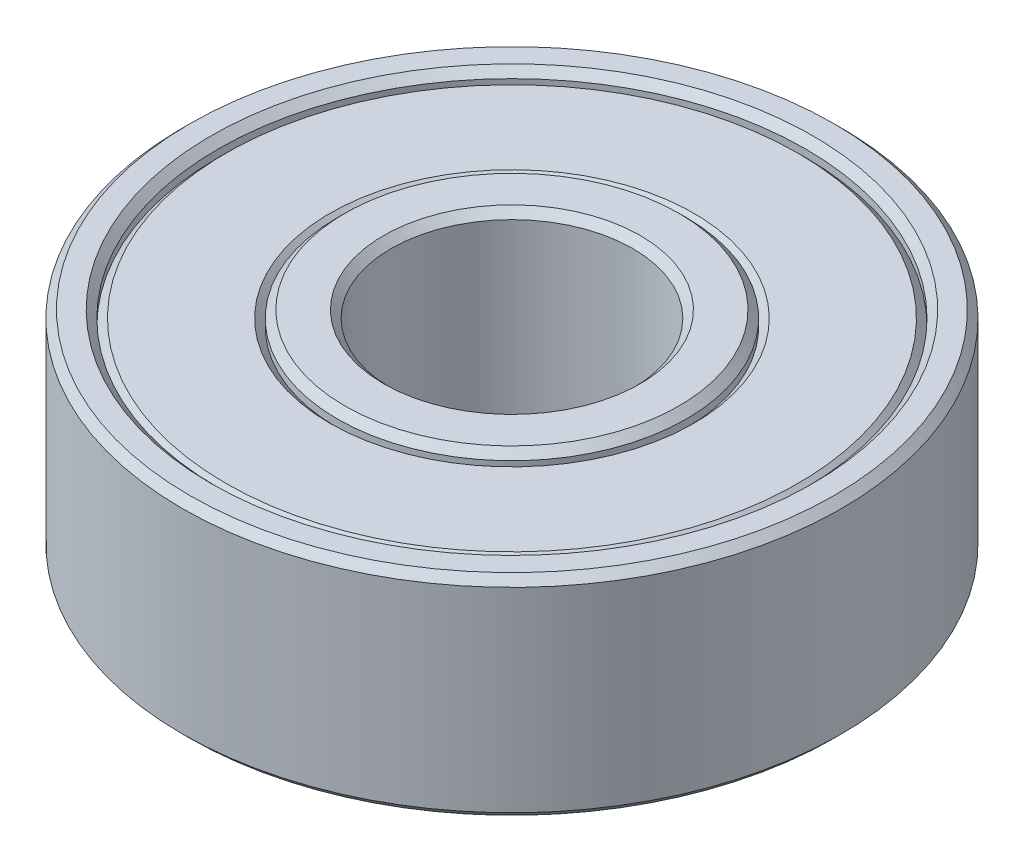
ISO-10303-21;
HEADER;
FILE_DESCRIPTION(('STEP AP214'),'2;1');
FILE_NAME('part.step','',(''),(''),'','','');
FILE_SCHEMA(('AUTOMOTIVE_DESIGN { 1 0 10303 214 1 1 1 1 }'));
ENDSEC;
DATA;
#1=APPLICATION_CONTEXT('core data for automotive mechanical design processes');
#2=APPLICATION_PROTOCOL_DEFINITION('international standard','automotive_design',2000,#1);
#3=PRODUCT_CONTEXT('',#1,'mechanical');
#4=PRODUCT('Part','Part','',(#3));
#5=PRODUCT_RELATED_PRODUCT_CATEGORY('part','',(#4));
#6=PRODUCT_DEFINITION_FORMATION('','',#4);
#7=PRODUCT_DEFINITION_CONTEXT('part definition',#1,'design');
#8=PRODUCT_DEFINITION('design','',#6,#7);
#9=PRODUCT_DEFINITION_SHAPE('','',#8);
#10=(LENGTH_UNIT() NAMED_UNIT(*) SI_UNIT(.MILLI.,.METRE.));
#11=(NAMED_UNIT(*) PLANE_ANGLE_UNIT() SI_UNIT($,.RADIAN.));
#12=(NAMED_UNIT(*) SI_UNIT($,.STERADIAN.) SOLID_ANGLE_UNIT());
#13=UNCERTAINTY_MEASURE_WITH_UNIT(LENGTH_MEASURE(1.E-05),#10,'distance_accuracy_value','');
#14=(GEOMETRIC_REPRESENTATION_CONTEXT(3) GLOBAL_UNCERTAINTY_ASSIGNED_CONTEXT((#13)) GLOBAL_UNIT_ASSIGNED_CONTEXT((#10,
#11,#12)) REPRESENTATION_CONTEXT('',''));
#15=CARTESIAN_POINT('',(0.,0.,0.));
#16=DIRECTION('',(0.,0.,1.));
#17=DIRECTION('',(1.,0.,0.));
#18=AXIS2_PLACEMENT_3D('',#15,#16,#17);
#19=CARTESIAN_POINT('',(0.,3.25,0.));
#20=DIRECTION('',(0.,1.,0.));
#21=DIRECTION('',(0.,0.,1.));
#22=AXIS2_PLACEMENT_3D('',#19,#20,#21);
#23=PLANE('',#22);
#24=CARTESIAN_POINT('',(0.,3.25,0.));
#25=DIRECTION('',(0.,1.,0.));
#26=DIRECTION('',(0.,0.,1.));
#27=AXIS2_PLACEMENT_3D('',#24,#25,#26);
#28=CIRCLE('',#27,6.06000000000001);
#29=CARTESIAN_POINT('',(0.,3.25,6.06000000000001));
#30=VERTEX_POINT('',#29);
#31=EDGE_CURVE('E11',#30,#30,#28,.F.);
#32=ORIENTED_EDGE('',*,*,#31,.T.);
#33=EDGE_LOOP('',(#32));
#34=FACE_BOUND('',#33,.T.);
#35=CARTESIAN_POINT('',(0.,3.25,0.));
#36=DIRECTION('',(0.,1.,0.));
#37=DIRECTION('',(0.,0.,1.));
#38=AXIS2_PLACEMENT_3D('',#35,#36,#37);
#39=CIRCLE('',#38,9.52500000000001);
#40=CARTESIAN_POINT('',(0.,3.25,9.52500000000001));
#41=VERTEX_POINT('',#40);
#42=EDGE_CURVE('E55',#41,#41,#39,.T.);
#43=ORIENTED_EDGE('',*,*,#42,.T.);
#44=EDGE_LOOP('',(#43));
#45=FACE_BOUND('',#44,.T.);
#46=ADVANCED_FACE('F47',(#34,#45),#23,.T.);
#47=CARTESIAN_POINT('',(0.,-3.25,0.));
#48=DIRECTION('',(0.,1.,0.));
#49=DIRECTION('',(0.,0.,1.));
#50=AXIS2_PLACEMENT_3D('',#47,#48,#49);
#51=PLANE('',#50);
#52=CARTESIAN_POINT('',(0.,-3.25,0.));
#53=DIRECTION('',(0.,1.,0.));
#54=DIRECTION('',(0.,0.,1.));
#55=AXIS2_PLACEMENT_3D('',#52,#53,#54);
#56=CIRCLE('',#55,6.05999999999999);
#57=CARTESIAN_POINT('',(0.,-3.25,6.05999999999999));
#58=VERTEX_POINT('',#57);
#59=EDGE_CURVE('E74',#58,#58,#56,.T.);
#60=ORIENTED_EDGE('',*,*,#59,.T.);
#61=EDGE_LOOP('',(#60));
#62=FACE_BOUND('',#61,.T.);
#63=CARTESIAN_POINT('',(0.,-3.25,0.));
#64=DIRECTION('',(0.,1.,0.));
#65=DIRECTION('',(0.,0.,1.));
#66=AXIS2_PLACEMENT_3D('',#63,#64,#65);
#67=CIRCLE('',#66,9.52499999999999);
#68=CARTESIAN_POINT('',(0.,-3.25,9.52499999999999));
#69=VERTEX_POINT('',#68);
#70=EDGE_CURVE('E77',#69,#69,#67,.F.);
#71=ORIENTED_EDGE('',*,*,#70,.T.);
#72=EDGE_LOOP('',(#71));
#73=FACE_BOUND('',#72,.T.);
#74=ADVANCED_FACE('F162',(#62,#73),#51,.F.);
#75=CARTESIAN_POINT('',(0.,-3.25,0.));
#76=DIRECTION('',(0.,-1.,0.));
#77=DIRECTION('',(0.,0.,-1.));
#78=AXIS2_PLACEMENT_3D('',#75,#76,#77);
#79=CONICAL_SURFACE('',#78,6.05999999999999,0.785398163397452);
#80=CARTESIAN_POINT('',(0.,-3.00000000000001,0.));
#81=DIRECTION('',(0.,1.,0.));
#82=DIRECTION('',(0.,0.,1.));
#83=AXIS2_PLACEMENT_3D('',#80,#81,#82);
#84=CIRCLE('',#83,5.81);
#85=CARTESIAN_POINT('',(0.,-3.00000000000001,5.81));
#86=VERTEX_POINT('',#85);
#87=EDGE_CURVE('E68',#86,#86,#84,.F.);
#88=ORIENTED_EDGE('',*,*,#87,.F.);
#89=EDGE_LOOP('',(#88));
#90=FACE_BOUND('',#89,.T.);
#91=ORIENTED_EDGE('',*,*,#59,.F.);
#92=EDGE_LOOP('',(#91));
#93=FACE_BOUND('',#92,.T.);
#94=ADVANCED_FACE('F167',(#90,#93),#79,.F.);
#95=CARTESIAN_POINT('',(0.,-2.99999999999999,0.));
#96=DIRECTION('',(0.,1.,0.));
#97=DIRECTION('',(0.,0.,1.));
#98=AXIS2_PLACEMENT_3D('',#95,#96,#97);
#99=CONICAL_SURFACE('',#98,9.775,0.785398163397452);
#100=ORIENTED_EDGE('',*,*,#70,.F.);
#101=EDGE_LOOP('',(#100));
#102=FACE_BOUND('',#101,.T.);
#103=CARTESIAN_POINT('',(0.,-2.99999999999999,0.));
#104=DIRECTION('',(0.,1.,0.));
#105=DIRECTION('',(0.,0.,1.));
#106=AXIS2_PLACEMENT_3D('',#103,#104,#105);
#107=CIRCLE('',#106,9.775);
#108=CARTESIAN_POINT('',(0.,-2.99999999999999,9.775));
#109=VERTEX_POINT('',#108);
#110=EDGE_CURVE('E59',#109,#109,#107,.T.);
#111=ORIENTED_EDGE('',*,*,#110,.F.);
#112=EDGE_LOOP('',(#111));
#113=FACE_BOUND('',#112,.T.);
#114=ADVANCED_FACE('F181',(#102,#113),#99,.T.);
#115=CARTESIAN_POINT('',(0.,2.99999999999999,0.));
#116=DIRECTION('',(0.,1.,0.));
#117=DIRECTION('',(0.,0.,1.));
#118=AXIS2_PLACEMENT_3D('',#115,#116,#117);
#119=CONICAL_SURFACE('',#118,5.81,0.78539816339745);
#120=ORIENTED_EDGE('',*,*,#31,.F.);
#121=EDGE_LOOP('',(#120));
#122=FACE_BOUND('',#121,.T.);
#123=CARTESIAN_POINT('',(0.,2.99999999999999,0.));
#124=DIRECTION('',(0.,1.,0.));
#125=DIRECTION('',(0.,0.,1.));
#126=AXIS2_PLACEMENT_3D('',#123,#124,#125);
#127=CIRCLE('',#126,5.81);
#128=CARTESIAN_POINT('',(0.,2.99999999999999,5.81));
#129=VERTEX_POINT('',#128);
#130=EDGE_CURVE('E71',#129,#129,#127,.T.);
#131=ORIENTED_EDGE('',*,*,#130,.F.);
#132=EDGE_LOOP('',(#131));
#133=FACE_BOUND('',#132,.T.);
#134=ADVANCED_FACE('F187',(#122,#133),#119,.F.);
#135=CARTESIAN_POINT('',(0.,3.25,0.));
#136=DIRECTION('',(0.,-1.,0.));
#137=DIRECTION('',(0.,0.,-1.));
#138=AXIS2_PLACEMENT_3D('',#135,#136,#137);
#139=CONICAL_SURFACE('',#138,9.52500000000001,0.785398163397448);
#140=CARTESIAN_POINT('',(0.,3.00000000000001,0.));
#141=DIRECTION('',(0.,1.,0.));
#142=DIRECTION('',(0.,0.,1.));
#143=AXIS2_PLACEMENT_3D('',#140,#141,#142);
#144=CIRCLE('',#143,9.775);
#145=CARTESIAN_POINT('',(0.,3.00000000000001,9.775));
#146=VERTEX_POINT('',#145);
#147=EDGE_CURVE('E63',#146,#146,#144,.F.);
#148=ORIENTED_EDGE('',*,*,#147,.F.);
#149=EDGE_LOOP('',(#148));
#150=FACE_BOUND('',#149,.T.);
#151=ORIENTED_EDGE('',*,*,#42,.F.);
#152=EDGE_LOOP('',(#151));
#153=FACE_BOUND('',#152,.T.);
#154=ADVANCED_FACE('F50',(#150,#153),#139,.T.);
#155=CARTESIAN_POINT('',(0.,3.5,0.));
#156=DIRECTION('',(0.,-1.,0.));
#157=DIRECTION('',(0.,0.,-1.));
#158=AXIS2_PLACEMENT_3D('',#155,#156,#157);
#159=CYLINDRICAL_SURFACE('',#158,5.81);
#160=ORIENTED_EDGE('',*,*,#87,.T.);
#161=EDGE_LOOP('',(#160));
#162=FACE_BOUND('',#161,.T.);
#163=CARTESIAN_POINT('',(0.,-3.24999999999999,0.));
#164=DIRECTION('',(0.,1.,0.));
#165=DIRECTION('',(0.,0.,1.));
#166=AXIS2_PLACEMENT_3D('',#163,#164,#165);
#167=CIRCLE('',#166,5.81);
#168=CARTESIAN_POINT('',(0.,-3.24999999999999,5.81));
#169=VERTEX_POINT('',#168);
#170=EDGE_CURVE('E95',#169,#169,#167,.T.);
#171=ORIENTED_EDGE('',*,*,#170,.T.);
#172=EDGE_LOOP('',(#171));
#173=FACE_BOUND('',#172,.T.);
#174=ADVANCED_FACE('F196',(#162,#173),#159,.T.);
#175=CARTESIAN_POINT('',(0.,3.5,0.));
#176=DIRECTION('',(0.,-1.,0.));
#177=DIRECTION('',(0.,0.,-1.));
#178=AXIS2_PLACEMENT_3D('',#175,#176,#177);
#179=CYLINDRICAL_SURFACE('',#178,4.025);
#180=CARTESIAN_POINT('',(0.,3.24999999999999,0.));
#181=DIRECTION('',(0.,1.,0.));
#182=DIRECTION('',(0.,0.,1.));
#183=AXIS2_PLACEMENT_3D('',#180,#181,#182);
#184=CIRCLE('',#183,4.025);
#185=CARTESIAN_POINT('',(0.,3.24999999999999,4.025));
#186=VERTEX_POINT('',#185);
#187=EDGE_CURVE('E86',#186,#186,#184,.T.);
#188=ORIENTED_EDGE('',*,*,#187,.T.);
#189=EDGE_LOOP('',(#188));
#190=FACE_BOUND('',#189,.T.);
#191=CARTESIAN_POINT('',(0.,-3.25,0.));
#192=DIRECTION('',(0.,1.,0.));
#193=DIRECTION('',(0.,0.,1.));
#194=AXIS2_PLACEMENT_3D('',#191,#192,#193);
#195=CIRCLE('',#194,4.025);
#196=CARTESIAN_POINT('',(0.,-3.25,4.025));
#197=VERTEX_POINT('',#196);
#198=EDGE_CURVE('E89',#197,#197,#195,.F.);
#199=ORIENTED_EDGE('',*,*,#198,.T.);
#200=EDGE_LOOP('',(#199));
#201=FACE_BOUND('',#200,.T.);
#202=ADVANCED_FACE('F205',(#190,#201),#179,.F.);
#203=ORIENTED_EDGE('',*,*,#130,.T.);
#204=EDGE_LOOP('',(#203));
#205=FACE_BOUND('',#204,.T.);
#206=CARTESIAN_POINT('',(0.,3.25,0.));
#207=DIRECTION('',(0.,1.,0.));
#208=DIRECTION('',(0.,0.,1.));
#209=AXIS2_PLACEMENT_3D('',#206,#207,#208);
#210=CIRCLE('',#209,5.81);
#211=CARTESIAN_POINT('',(0.,3.25,5.81));
#212=VERTEX_POINT('',#211);
#213=EDGE_CURVE('E92',#212,#212,#210,.F.);
#214=ORIENTED_EDGE('',*,*,#213,.T.);
#215=EDGE_LOOP('',(#214));
#216=FACE_BOUND('',#215,.T.);
#217=ADVANCED_FACE('F201',(#205,#216),#159,.T.);
#218=CARTESIAN_POINT('',(0.,3.5,0.));
#219=DIRECTION('',(0.,1.,0.));
#220=DIRECTION('',(0.,0.,1.));
#221=AXIS2_PLACEMENT_3D('',#218,#219,#220);
#222=PLANE('',#221);
#223=CARTESIAN_POINT('',(0.,3.5,0.));
#224=DIRECTION('',(0.,1.,0.));
#225=DIRECTION('',(0.,0.,1.));
#226=AXIS2_PLACEMENT_3D('',#223,#224,#225);
#227=CIRCLE('',#226,5.56);
#228=CARTESIAN_POINT('',(0.,3.5,5.56));
#229=VERTEX_POINT('',#228);
#230=EDGE_CURVE('E98',#229,#229,#227,.T.);
#231=ORIENTED_EDGE('',*,*,#230,.T.);
#232=EDGE_LOOP('',(#231));
#233=FACE_BOUND('',#232,.T.);
#234=CARTESIAN_POINT('',(0.,3.5,0.));
#235=DIRECTION('',(0.,1.,0.));
#236=DIRECTION('',(0.,0.,1.));
#237=AXIS2_PLACEMENT_3D('',#234,#235,#236);
#238=CIRCLE('',#237,4.27500000000001);
#239=CARTESIAN_POINT('',(0.,3.5,4.27500000000001));
#240=VERTEX_POINT('',#239);
#241=EDGE_CURVE('E101',#240,#240,#238,.F.);
#242=ORIENTED_EDGE('',*,*,#241,.T.);
#243=EDGE_LOOP('',(#242));
#244=FACE_BOUND('',#243,.T.);
#245=ADVANCED_FACE('F204',(#233,#244),#222,.T.);
#246=CARTESIAN_POINT('',(0.,-3.5,0.));
#247=DIRECTION('',(0.,1.,0.));
#248=DIRECTION('',(0.,0.,1.));
#249=AXIS2_PLACEMENT_3D('',#246,#247,#248);
#250=PLANE('',#249);
#251=CARTESIAN_POINT('',(0.,-3.5,0.));
#252=DIRECTION('',(0.,1.,0.));
#253=DIRECTION('',(0.,0.,1.));
#254=AXIS2_PLACEMENT_3D('',#251,#252,#253);
#255=CIRCLE('',#254,4.275);
#256=CARTESIAN_POINT('',(0.,-3.5,4.275));
#257=VERTEX_POINT('',#256);
#258=EDGE_CURVE('E80',#257,#257,#255,.T.);
#259=ORIENTED_EDGE('',*,*,#258,.T.);
#260=EDGE_LOOP('',(#259));
#261=FACE_BOUND('',#260,.T.);
#262=CARTESIAN_POINT('',(0.,-3.5,0.));
#263=DIRECTION('',(0.,1.,0.));
#264=DIRECTION('',(0.,0.,1.));
#265=AXIS2_PLACEMENT_3D('',#262,#263,#264);
#266=CIRCLE('',#265,5.55999999999999);
#267=CARTESIAN_POINT('',(0.,-3.5,5.55999999999999));
#268=VERTEX_POINT('',#267);
#269=EDGE_CURVE('E83',#268,#268,#266,.F.);
#270=ORIENTED_EDGE('',*,*,#269,.T.);
#271=EDGE_LOOP('',(#270));
#272=FACE_BOUND('',#271,.T.);
#273=ADVANCED_FACE('F213',(#261,#272),#250,.F.);
#274=CARTESIAN_POINT('',(0.,3.5,0.));
#275=DIRECTION('',(0.,-1.,0.));
#276=DIRECTION('',(0.,0.,-1.));
#277=AXIS2_PLACEMENT_3D('',#274,#275,#276);
#278=CONICAL_SURFACE('',#277,5.56,0.785398163397441);
#279=ORIENTED_EDGE('',*,*,#213,.F.);
#280=EDGE_LOOP('',(#279));
#281=FACE_BOUND('',#280,.T.);
#282=ORIENTED_EDGE('',*,*,#230,.F.);
#283=EDGE_LOOP('',(#282));
#284=FACE_BOUND('',#283,.T.);
#285=ADVANCED_FACE('F209',(#281,#284),#278,.T.);
#286=CARTESIAN_POINT('',(0.,3.24999999999999,0.));
#287=DIRECTION('',(0.,1.,0.));
#288=DIRECTION('',(0.,0.,1.));
#289=AXIS2_PLACEMENT_3D('',#286,#287,#288);
#290=CONICAL_SURFACE('',#289,4.025,0.785398163397448);
#291=ORIENTED_EDGE('',*,*,#241,.F.);
#292=EDGE_LOOP('',(#291));
#293=FACE_BOUND('',#292,.T.);
#294=ORIENTED_EDGE('',*,*,#187,.F.);
#295=EDGE_LOOP('',(#294));
#296=FACE_BOUND('',#295,.T.);
#297=ADVANCED_FACE('F212',(#293,#296),#290,.F.);
#298=CARTESIAN_POINT('',(0.,-3.5,0.));
#299=DIRECTION('',(0.,-1.,0.));
#300=DIRECTION('',(0.,0.,-1.));
#301=AXIS2_PLACEMENT_3D('',#298,#299,#300);
#302=CONICAL_SURFACE('',#301,4.275,0.785398163397445);
#303=ORIENTED_EDGE('',*,*,#198,.F.);
#304=EDGE_LOOP('',(#303));
#305=FACE_BOUND('',#304,.T.);
#306=ORIENTED_EDGE('',*,*,#258,.F.);
#307=EDGE_LOOP('',(#306));
#308=FACE_BOUND('',#307,.T.);
#309=ADVANCED_FACE('F224',(#305,#308),#302,.F.);
#310=CARTESIAN_POINT('',(0.,-3.24999999999999,0.));
#311=DIRECTION('',(0.,1.,0.));
#312=DIRECTION('',(0.,0.,1.));
#313=AXIS2_PLACEMENT_3D('',#310,#311,#312);
#314=CONICAL_SURFACE('',#313,5.81,0.785398163397447);
#315=ORIENTED_EDGE('',*,*,#269,.F.);
#316=EDGE_LOOP('',(#315));
#317=FACE_BOUND('',#316,.T.);
#318=ORIENTED_EDGE('',*,*,#170,.F.);
#319=EDGE_LOOP('',(#318));
#320=FACE_BOUND('',#319,.T.);
#321=ADVANCED_FACE('F172',(#317,#320),#314,.T.);
#322=CARTESIAN_POINT('',(0.,3.5,0.));
#323=DIRECTION('',(0.,-1.,0.));
#324=DIRECTION('',(0.,0.,-1.));
#325=AXIS2_PLACEMENT_3D('',#322,#323,#324);
#326=CYLINDRICAL_SURFACE('',#325,9.775);
#327=ORIENTED_EDGE('',*,*,#110,.T.);
#328=EDGE_LOOP('',(#327));
#329=FACE_BOUND('',#328,.T.);
#330=CARTESIAN_POINT('',(0.,-3.25,0.));
#331=DIRECTION('',(0.,1.,0.));
#332=DIRECTION('',(0.,0.,1.));
#333=AXIS2_PLACEMENT_3D('',#330,#331,#332);
#334=CIRCLE('',#333,9.775);
#335=CARTESIAN_POINT('',(0.,-3.25,9.775));
#336=VERTEX_POINT('',#335);
#337=EDGE_CURVE('E116',#336,#336,#334,.F.);
#338=ORIENTED_EDGE('',*,*,#337,.T.);
#339=EDGE_LOOP('',(#338));
#340=FACE_BOUND('',#339,.T.);
#341=ADVANCED_FACE('F244',(#329,#340),#326,.F.);
#342=ORIENTED_EDGE('',*,*,#147,.T.);
#343=EDGE_LOOP('',(#342));
#344=FACE_BOUND('',#343,.T.);
#345=CARTESIAN_POINT('',(0.,3.25,0.));
#346=DIRECTION('',(0.,1.,0.));
#347=DIRECTION('',(0.,0.,1.));
#348=AXIS2_PLACEMENT_3D('',#345,#346,#347);
#349=CIRCLE('',#348,9.775);
#350=CARTESIAN_POINT('',(0.,3.25,9.775));
#351=VERTEX_POINT('',#350);
#352=EDGE_CURVE('E119',#351,#351,#349,.T.);
#353=ORIENTED_EDGE('',*,*,#352,.T.);
#354=EDGE_LOOP('',(#353));
#355=FACE_BOUND('',#354,.T.);
#356=ADVANCED_FACE('F143',(#344,#355),#326,.F.);
#357=CARTESIAN_POINT('',(0.,3.5,0.));
#358=DIRECTION('',(0.,-1.,0.));
#359=DIRECTION('',(0.,0.,-1.));
#360=AXIS2_PLACEMENT_3D('',#357,#358,#359);
#361=CYLINDRICAL_SURFACE('',#360,10.975);
#362=CARTESIAN_POINT('',(0.,-3.25,0.));
#363=DIRECTION('',(0.,1.,0.));
#364=DIRECTION('',(0.,0.,1.));
#365=AXIS2_PLACEMENT_3D('',#362,#363,#364);
#366=CIRCLE('',#365,10.975);
#367=CARTESIAN_POINT('',(0.,-3.25,10.975));
#368=VERTEX_POINT('',#367);
#369=EDGE_CURVE('E104',#368,#368,#366,.T.);
#370=ORIENTED_EDGE('',*,*,#369,.T.);
#371=EDGE_LOOP('',(#370));
#372=FACE_BOUND('',#371,.T.);
#373=CARTESIAN_POINT('',(0.,3.25,0.));
#374=DIRECTION('',(0.,1.,0.));
#375=DIRECTION('',(0.,0.,1.));
#376=AXIS2_PLACEMENT_3D('',#373,#374,#375);
#377=CIRCLE('',#376,10.975);
#378=CARTESIAN_POINT('',(0.,3.25,10.975));
#379=VERTEX_POINT('',#378);
#380=EDGE_CURVE('E107',#379,#379,#377,.F.);
#381=ORIENTED_EDGE('',*,*,#380,.T.);
#382=EDGE_LOOP('',(#381));
#383=FACE_BOUND('',#382,.T.);
#384=ADVANCED_FACE('F139',(#372,#383),#361,.T.);
#385=CARTESIAN_POINT('',(0.,3.5,0.));
#386=DIRECTION('',(0.,1.,0.));
#387=DIRECTION('',(0.,0.,1.));
#388=AXIS2_PLACEMENT_3D('',#385,#386,#387);
#389=PLANE('',#388);
#390=CARTESIAN_POINT('',(0.,3.5,0.));
#391=DIRECTION('',(0.,1.,0.));
#392=DIRECTION('',(0.,0.,1.));
#393=AXIS2_PLACEMENT_3D('',#390,#391,#392);
#394=CIRCLE('',#393,10.025);
#395=CARTESIAN_POINT('',(0.,3.5,10.025));
#396=VERTEX_POINT('',#395);
#397=EDGE_CURVE('E110',#396,#396,#394,.F.);
#398=ORIENTED_EDGE('',*,*,#397,.T.);
#399=EDGE_LOOP('',(#398));
#400=FACE_BOUND('',#399,.T.);
#401=CARTESIAN_POINT('',(0.,3.5,0.));
#402=DIRECTION('',(0.,1.,0.));
#403=DIRECTION('',(0.,0.,1.));
#404=AXIS2_PLACEMENT_3D('',#401,#402,#403);
#405=CIRCLE('',#404,10.725);
#406=CARTESIAN_POINT('',(0.,3.5,10.725));
#407=VERTEX_POINT('',#406);
#408=EDGE_CURVE('E113',#407,#407,#405,.T.);
#409=ORIENTED_EDGE('',*,*,#408,.T.);
#410=EDGE_LOOP('',(#409));
#411=FACE_BOUND('',#410,.T.);
#412=ADVANCED_FACE('F142',(#400,#411),#389,.T.);
#413=CARTESIAN_POINT('',(0.,-3.5,0.));
#414=DIRECTION('',(0.,1.,0.));
#415=DIRECTION('',(0.,0.,1.));
#416=AXIS2_PLACEMENT_3D('',#413,#414,#415);
#417=PLANE('',#416);
#418=CARTESIAN_POINT('',(0.,-3.5,0.));
#419=DIRECTION('',(0.,1.,0.));
#420=DIRECTION('',(0.,0.,1.));
#421=AXIS2_PLACEMENT_3D('',#418,#419,#420);
#422=CIRCLE('',#421,10.025);
#423=CARTESIAN_POINT('',(0.,-3.5,10.025));
#424=VERTEX_POINT('',#423);
#425=EDGE_CURVE('E122',#424,#424,#422,.T.);
#426=ORIENTED_EDGE('',*,*,#425,.T.);
#427=EDGE_LOOP('',(#426));
#428=FACE_BOUND('',#427,.T.);
#429=CARTESIAN_POINT('',(0.,-3.5,0.));
#430=DIRECTION('',(0.,1.,0.));
#431=DIRECTION('',(0.,0.,1.));
#432=AXIS2_PLACEMENT_3D('',#429,#430,#431);
#433=CIRCLE('',#432,10.725);
#434=CARTESIAN_POINT('',(0.,-3.5,10.725));
#435=VERTEX_POINT('',#434);
#436=EDGE_CURVE('E125',#435,#435,#433,.F.);
#437=ORIENTED_EDGE('',*,*,#436,.T.);
#438=EDGE_LOOP('',(#437));
#439=FACE_BOUND('',#438,.T.);
#440=ADVANCED_FACE('F129',(#428,#439),#417,.F.);
#441=CARTESIAN_POINT('',(0.,-3.5,0.));
#442=DIRECTION('',(0.,-1.,0.));
#443=DIRECTION('',(0.,0.,-1.));
#444=AXIS2_PLACEMENT_3D('',#441,#442,#443);
#445=CONICAL_SURFACE('',#444,10.025,0.785398163397441);
#446=ORIENTED_EDGE('',*,*,#337,.F.);
#447=EDGE_LOOP('',(#446));
#448=FACE_BOUND('',#447,.T.);
#449=ORIENTED_EDGE('',*,*,#425,.F.);
#450=EDGE_LOOP('',(#449));
#451=FACE_BOUND('',#450,.T.);
#452=ADVANCED_FACE('F158',(#448,#451),#445,.F.);
#453=CARTESIAN_POINT('',(0.,3.25,0.));
#454=DIRECTION('',(0.,1.,0.));
#455=DIRECTION('',(0.,0.,1.));
#456=AXIS2_PLACEMENT_3D('',#453,#454,#455);
#457=CONICAL_SURFACE('',#456,9.775,0.785398163397452);
#458=ORIENTED_EDGE('',*,*,#397,.F.);
#459=EDGE_LOOP('',(#458));
#460=FACE_BOUND('',#459,.T.);
#461=ORIENTED_EDGE('',*,*,#352,.F.);
#462=EDGE_LOOP('',(#461));
#463=FACE_BOUND('',#462,.T.);
#464=ADVANCED_FACE('F135',(#460,#463),#457,.F.);
#465=CARTESIAN_POINT('',(0.,-3.25,0.));
#466=DIRECTION('',(0.,1.,0.));
#467=DIRECTION('',(0.,0.,1.));
#468=AXIS2_PLACEMENT_3D('',#465,#466,#467);
#469=CONICAL_SURFACE('',#468,10.975,0.785398163397455);
#470=ORIENTED_EDGE('',*,*,#436,.F.);
#471=EDGE_LOOP('',(#470));
#472=FACE_BOUND('',#471,.T.);
#473=ORIENTED_EDGE('',*,*,#369,.F.);
#474=EDGE_LOOP('',(#473));
#475=FACE_BOUND('',#474,.T.);
#476=ADVANCED_FACE('F131',(#472,#475),#469,.T.);
#477=CARTESIAN_POINT('',(0.,3.5,0.));
#478=DIRECTION('',(0.,-1.,0.));
#479=DIRECTION('',(0.,0.,-1.));
#480=AXIS2_PLACEMENT_3D('',#477,#478,#479);
#481=CONICAL_SURFACE('',#480,10.725,0.785398163397445);
#482=ORIENTED_EDGE('',*,*,#380,.F.);
#483=EDGE_LOOP('',(#482));
#484=FACE_BOUND('',#483,.T.);
#485=ORIENTED_EDGE('',*,*,#408,.F.);
#486=EDGE_LOOP('',(#485));
#487=FACE_BOUND('',#486,.T.);
#488=ADVANCED_FACE('F134',(#484,#487),#481,.T.);
#489=CLOSED_SHELL('',(#46,#74,#94,#114,#134,#154,#174,#202,#217,#245,#273,#285,#297,#309,#321,
#341,#356,#384,#412,#440,#452,#464,#476,#488));
#490=MANIFOLD_SOLID_BREP('B2',#489);
#491=ADVANCED_BREP_SHAPE_REPRESENTATION('',(#18,#490),#14);
#492=SHAPE_DEFINITION_REPRESENTATION(#9,#491);
ENDSEC;
END-ISO-10303-21;
